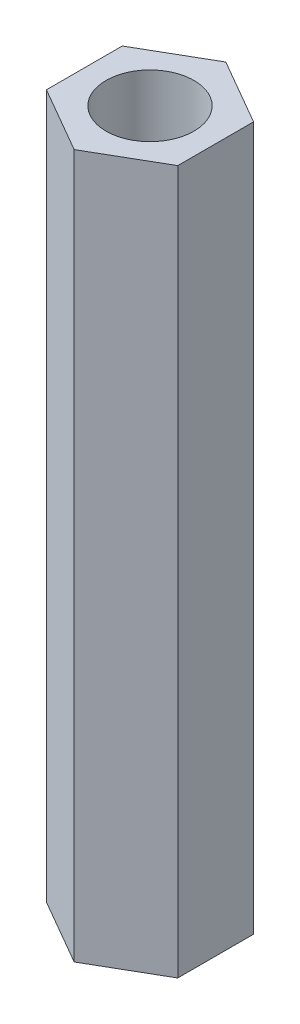
ISO-10303-21;
HEADER;
FILE_DESCRIPTION(('STEP AP214'),'2;1');
FILE_NAME('part.step','',(''),(''),'','','');
FILE_SCHEMA(('AUTOMOTIVE_DESIGN { 1 0 10303 214 1 1 1 1 }'));
ENDSEC;
DATA;
#1=APPLICATION_CONTEXT('core data for automotive mechanical design processes');
#2=APPLICATION_PROTOCOL_DEFINITION('international standard','automotive_design',2000,#1);
#3=PRODUCT_CONTEXT('',#1,'mechanical');
#4=PRODUCT('Part','Part','',(#3));
#5=PRODUCT_RELATED_PRODUCT_CATEGORY('part','',(#4));
#6=PRODUCT_DEFINITION_FORMATION('','',#4);
#7=PRODUCT_DEFINITION_CONTEXT('part definition',#1,'design');
#8=PRODUCT_DEFINITION('design','',#6,#7);
#9=PRODUCT_DEFINITION_SHAPE('','',#8);
#10=(LENGTH_UNIT() NAMED_UNIT(*) SI_UNIT(.MILLI.,.METRE.));
#11=(NAMED_UNIT(*) PLANE_ANGLE_UNIT() SI_UNIT($,.RADIAN.));
#12=(NAMED_UNIT(*) SI_UNIT($,.STERADIAN.) SOLID_ANGLE_UNIT());
#13=UNCERTAINTY_MEASURE_WITH_UNIT(LENGTH_MEASURE(1.E-05),#10,'distance_accuracy_value','');
#14=(GEOMETRIC_REPRESENTATION_CONTEXT(3) GLOBAL_UNCERTAINTY_ASSIGNED_CONTEXT((#13)) GLOBAL_UNIT_ASSIGNED_CONTEXT((#10,
#11,#12)) REPRESENTATION_CONTEXT('',''));
#15=CARTESIAN_POINT('',(0.,0.,0.));
#16=DIRECTION('',(0.,0.,1.));
#17=DIRECTION('',(1.,0.,0.));
#18=AXIS2_PLACEMENT_3D('',#15,#16,#17);
#19=CARTESIAN_POINT('',(0.,19.05,0.));
#20=DIRECTION('',(0.,1.,0.));
#21=DIRECTION('',(0.,0.,1.));
#22=AXIS2_PLACEMENT_3D('',#19,#20,#21);
#23=PLANE('',#22);
#24=DIRECTION('',(0.866025403784438,0.,0.5));
#25=VECTOR('',#24,1.);
#26=CARTESIAN_POINT('',(-1.778,19.05,1.02652877861915));
#27=LINE('',#26,#25);
#28=CARTESIAN_POINT('',(-1.778,19.05,1.02652877861915));
#29=VERTEX_POINT('',#28);
#30=CARTESIAN_POINT('',(0.,19.05,2.05305755723831));
#31=VERTEX_POINT('',#30);
#32=EDGE_CURVE('E129',#29,#31,#27,.T.);
#33=ORIENTED_EDGE('',*,*,#32,.T.);
#34=DIRECTION('',(0.866025403784439,0.,-0.5));
#35=VECTOR('',#34,1.);
#36=CARTESIAN_POINT('',(0.,19.05,2.05305755723831));
#37=LINE('',#36,#35);
#38=CARTESIAN_POINT('',(1.778,19.05,1.02652877861915));
#39=VERTEX_POINT('',#38);
#40=EDGE_CURVE('E87',#31,#39,#37,.T.);
#41=ORIENTED_EDGE('',*,*,#40,.T.);
#42=DIRECTION('',(0.,0.,-1.));
#43=VECTOR('',#42,1.);
#44=CARTESIAN_POINT('',(1.778,19.05,1.02652877861915));
#45=LINE('',#44,#43);
#46=CARTESIAN_POINT('',(1.778,19.05,-1.02652877861915));
#47=VERTEX_POINT('',#46);
#48=EDGE_CURVE('E100',#39,#47,#45,.T.);
#49=ORIENTED_EDGE('',*,*,#48,.T.);
#50=DIRECTION('',(-0.866025403784439,0.,-0.5));
#51=VECTOR('',#50,1.);
#52=CARTESIAN_POINT('',(1.778,19.05,-1.02652877861915));
#53=LINE('',#52,#51);
#54=CARTESIAN_POINT('',(0.,19.05,-2.05305755723831));
#55=VERTEX_POINT('',#54);
#56=EDGE_CURVE('E94',#47,#55,#53,.T.);
#57=ORIENTED_EDGE('',*,*,#56,.T.);
#58=DIRECTION('',(-0.866025403784439,0.,0.5));
#59=VECTOR('',#58,1.);
#60=CARTESIAN_POINT('',(0.,19.05,-2.05305755723831));
#61=LINE('',#60,#59);
#62=CARTESIAN_POINT('',(-1.778,19.05,-1.02652877861915));
#63=VERTEX_POINT('',#62);
#64=EDGE_CURVE('E98',#55,#63,#61,.T.);
#65=ORIENTED_EDGE('',*,*,#64,.T.);
#66=DIRECTION('',(0.,0.,1.));
#67=VECTOR('',#66,1.);
#68=CARTESIAN_POINT('',(-1.778,19.05,-1.02652877861915));
#69=LINE('',#68,#67);
#70=EDGE_CURVE('E50',#63,#29,#69,.T.);
#71=ORIENTED_EDGE('',*,*,#70,.T.);
#72=EDGE_LOOP('',(#33,#41,#49,#57,#65,#71));
#73=FACE_BOUND('',#72,.T.);
#74=CARTESIAN_POINT('',(0.,19.05,0.));
#75=DIRECTION('',(0.,1.,0.));
#76=DIRECTION('',(0.,0.,1.));
#77=AXIS2_PLACEMENT_3D('',#74,#75,#76);
#78=CIRCLE('',#77,1.190625);
#79=CARTESIAN_POINT('',(0.,19.05,1.190625));
#80=VERTEX_POINT('',#79);
#81=EDGE_CURVE('E122',#80,#80,#78,.T.);
#82=ORIENTED_EDGE('',*,*,#81,.F.);
#83=EDGE_LOOP('',(#82));
#84=FACE_BOUND('',#83,.T.);
#85=ADVANCED_FACE('F33',(#73,#84),#23,.T.);
#86=CARTESIAN_POINT('',(0.,0.,0.));
#87=DIRECTION('',(0.,1.,0.));
#88=DIRECTION('',(0.,0.,1.));
#89=AXIS2_PLACEMENT_3D('',#86,#87,#88);
#90=PLANE('',#89);
#91=DIRECTION('',(0.866025403784438,0.,0.5));
#92=VECTOR('',#91,1.);
#93=CARTESIAN_POINT('',(-1.778,0.,1.02652877861915));
#94=LINE('',#93,#92);
#95=CARTESIAN_POINT('',(-1.778,0.,1.02652877861915));
#96=VERTEX_POINT('',#95);
#97=CARTESIAN_POINT('',(0.,0.,2.05305755723831));
#98=VERTEX_POINT('',#97);
#99=EDGE_CURVE('E118',#96,#98,#94,.T.);
#100=ORIENTED_EDGE('',*,*,#99,.F.);
#101=DIRECTION('',(0.,0.,1.));
#102=VECTOR('',#101,1.);
#103=CARTESIAN_POINT('',(-1.778,0.,-1.02652877861915));
#104=LINE('',#103,#102);
#105=CARTESIAN_POINT('',(-1.778,0.,-1.02652877861915));
#106=VERTEX_POINT('',#105);
#107=EDGE_CURVE('E79',#106,#96,#104,.T.);
#108=ORIENTED_EDGE('',*,*,#107,.F.);
#109=DIRECTION('',(-0.866025403784439,0.,0.5));
#110=VECTOR('',#109,1.);
#111=CARTESIAN_POINT('',(0.,0.,-2.05305755723831));
#112=LINE('',#111,#110);
#113=CARTESIAN_POINT('',(0.,0.,-2.05305755723831));
#114=VERTEX_POINT('',#113);
#115=EDGE_CURVE('E73',#114,#106,#112,.T.);
#116=ORIENTED_EDGE('',*,*,#115,.F.);
#117=DIRECTION('',(-0.866025403784439,0.,-0.5));
#118=VECTOR('',#117,1.);
#119=CARTESIAN_POINT('',(1.778,0.,-1.02652877861915));
#120=LINE('',#119,#118);
#121=CARTESIAN_POINT('',(1.778,0.,-1.02652877861915));
#122=VERTEX_POINT('',#121);
#123=EDGE_CURVE('E108',#122,#114,#120,.T.);
#124=ORIENTED_EDGE('',*,*,#123,.F.);
#125=DIRECTION('',(0.,0.,-1.));
#126=VECTOR('',#125,1.);
#127=CARTESIAN_POINT('',(1.778,0.,1.02652877861915));
#128=LINE('',#127,#126);
#129=CARTESIAN_POINT('',(1.778,0.,1.02652877861915));
#130=VERTEX_POINT('',#129);
#131=EDGE_CURVE('E124',#130,#122,#128,.T.);
#132=ORIENTED_EDGE('',*,*,#131,.F.);
#133=DIRECTION('',(0.866025403784439,0.,-0.5));
#134=VECTOR('',#133,1.);
#135=CARTESIAN_POINT('',(0.,0.,2.05305755723831));
#136=LINE('',#135,#134);
#137=EDGE_CURVE('E121',#98,#130,#136,.T.);
#138=ORIENTED_EDGE('',*,*,#137,.F.);
#139=EDGE_LOOP('',(#100,#108,#116,#124,#132,#138));
#140=FACE_BOUND('',#139,.T.);
#141=CARTESIAN_POINT('',(0.,0.,0.));
#142=DIRECTION('',(0.,1.,0.));
#143=DIRECTION('',(0.,0.,1.));
#144=AXIS2_PLACEMENT_3D('',#141,#142,#143);
#145=CIRCLE('',#144,1.190625);
#146=CARTESIAN_POINT('',(0.,0.,1.190625));
#147=VERTEX_POINT('',#146);
#148=EDGE_CURVE('E222',#147,#147,#145,.T.);
#149=ORIENTED_EDGE('',*,*,#148,.T.);
#150=EDGE_LOOP('',(#149));
#151=FACE_BOUND('',#150,.T.);
#152=ADVANCED_FACE('F138',(#140,#151),#90,.F.);
#153=CARTESIAN_POINT('',(-1.778,19.05,1.02652877861915));
#154=DIRECTION('',(0.5,0.,-0.866025403784439));
#155=DIRECTION('',(-0.866025403784438,0.,-0.5));
#156=AXIS2_PLACEMENT_3D('',#153,#154,#155);
#157=PLANE('',#156);
#158=ORIENTED_EDGE('',*,*,#99,.T.);
#159=DIRECTION('',(0.,-1.,0.));
#160=VECTOR('',#159,1.);
#161=CARTESIAN_POINT('',(0.,19.05,2.05305755723831));
#162=LINE('',#161,#160);
#163=EDGE_CURVE('E11',#31,#98,#162,.T.);
#164=ORIENTED_EDGE('',*,*,#163,.F.);
#165=ORIENTED_EDGE('',*,*,#32,.F.);
#166=DIRECTION('',(0.,-1.,0.));
#167=VECTOR('',#166,1.);
#168=CARTESIAN_POINT('',(-1.778,19.05,1.02652877861915));
#169=LINE('',#168,#167);
#170=EDGE_CURVE('E114',#29,#96,#169,.T.);
#171=ORIENTED_EDGE('',*,*,#170,.T.);
#172=EDGE_LOOP('',(#158,#164,#165,#171));
#173=FACE_BOUND('',#172,.T.);
#174=ADVANCED_FACE('F35',(#173),#157,.F.);
#175=CARTESIAN_POINT('',(0.,19.05,2.05305755723831));
#176=DIRECTION('',(-0.5,0.,-0.866025403784439));
#177=DIRECTION('',(-0.866025403784439,0.,0.5));
#178=AXIS2_PLACEMENT_3D('',#175,#176,#177);
#179=PLANE('',#178);
#180=ORIENTED_EDGE('',*,*,#137,.T.);
#181=DIRECTION('',(0.,-1.,0.));
#182=VECTOR('',#181,1.);
#183=CARTESIAN_POINT('',(1.778,19.05,1.02652877861915));
#184=LINE('',#183,#182);
#185=EDGE_CURVE('E42',#39,#130,#184,.T.);
#186=ORIENTED_EDGE('',*,*,#185,.F.);
#187=ORIENTED_EDGE('',*,*,#40,.F.);
#188=ORIENTED_EDGE('',*,*,#163,.T.);
#189=EDGE_LOOP('',(#180,#186,#187,#188));
#190=FACE_BOUND('',#189,.T.);
#191=ADVANCED_FACE('F163',(#190),#179,.F.);
#192=CARTESIAN_POINT('',(1.778,19.05,1.02652877861915));
#193=DIRECTION('',(-1.,0.,0.));
#194=DIRECTION('',(0.,0.,1.));
#195=AXIS2_PLACEMENT_3D('',#192,#193,#194);
#196=PLANE('',#195);
#197=ORIENTED_EDGE('',*,*,#131,.T.);
#198=DIRECTION('',(0.,-1.,0.));
#199=VECTOR('',#198,1.);
#200=CARTESIAN_POINT('',(1.778,19.05,-1.02652877861915));
#201=LINE('',#200,#199);
#202=EDGE_CURVE('E109',#47,#122,#201,.T.);
#203=ORIENTED_EDGE('',*,*,#202,.F.);
#204=ORIENTED_EDGE('',*,*,#48,.F.);
#205=ORIENTED_EDGE('',*,*,#185,.T.);
#206=EDGE_LOOP('',(#197,#203,#204,#205));
#207=FACE_BOUND('',#206,.T.);
#208=ADVANCED_FACE('F135',(#207),#196,.F.);
#209=CARTESIAN_POINT('',(1.778,19.05,-1.02652877861915));
#210=DIRECTION('',(-0.5,0.,0.866025403784439));
#211=DIRECTION('',(0.866025403784438,0.,0.5));
#212=AXIS2_PLACEMENT_3D('',#209,#210,#211);
#213=PLANE('',#212);
#214=ORIENTED_EDGE('',*,*,#123,.T.);
#215=DIRECTION('',(0.,-1.,0.));
#216=VECTOR('',#215,1.);
#217=CARTESIAN_POINT('',(0.,19.05,-2.05305755723831));
#218=LINE('',#217,#216);
#219=EDGE_CURVE('E105',#55,#114,#218,.T.);
#220=ORIENTED_EDGE('',*,*,#219,.F.);
#221=ORIENTED_EDGE('',*,*,#56,.F.);
#222=ORIENTED_EDGE('',*,*,#202,.T.);
#223=EDGE_LOOP('',(#214,#220,#221,#222));
#224=FACE_BOUND('',#223,.T.);
#225=ADVANCED_FACE('F106',(#224),#213,.F.);
#226=CARTESIAN_POINT('',(0.,19.05,-2.05305755723831));
#227=DIRECTION('',(0.5,0.,0.866025403784439));
#228=DIRECTION('',(0.866025403784439,0.,-0.5));
#229=AXIS2_PLACEMENT_3D('',#226,#227,#228);
#230=PLANE('',#229);
#231=ORIENTED_EDGE('',*,*,#115,.T.);
#232=DIRECTION('',(0.,-1.,0.));
#233=VECTOR('',#232,1.);
#234=CARTESIAN_POINT('',(-1.778,19.05,-1.02652877861915));
#235=LINE('',#234,#233);
#236=EDGE_CURVE('E110',#63,#106,#235,.T.);
#237=ORIENTED_EDGE('',*,*,#236,.F.);
#238=ORIENTED_EDGE('',*,*,#64,.F.);
#239=ORIENTED_EDGE('',*,*,#219,.T.);
#240=EDGE_LOOP('',(#231,#237,#238,#239));
#241=FACE_BOUND('',#240,.T.);
#242=ADVANCED_FACE('F112',(#241),#230,.F.);
#243=CARTESIAN_POINT('',(-1.778,19.05,-1.02652877861915));
#244=DIRECTION('',(1.,0.,0.));
#245=DIRECTION('',(0.,0.,-1.));
#246=AXIS2_PLACEMENT_3D('',#243,#244,#245);
#247=PLANE('',#246);
#248=ORIENTED_EDGE('',*,*,#107,.T.);
#249=ORIENTED_EDGE('',*,*,#170,.F.);
#250=ORIENTED_EDGE('',*,*,#70,.F.);
#251=ORIENTED_EDGE('',*,*,#236,.T.);
#252=EDGE_LOOP('',(#248,#249,#250,#251));
#253=FACE_BOUND('',#252,.T.);
#254=ADVANCED_FACE('F143',(#253),#247,.F.);
#255=CARTESIAN_POINT('',(0.,19.05,0.));
#256=DIRECTION('',(0.,-1.,0.));
#257=DIRECTION('',(0.,0.,-1.));
#258=AXIS2_PLACEMENT_3D('',#255,#256,#257);
#259=CYLINDRICAL_SURFACE('',#258,1.190625);
#260=ORIENTED_EDGE('',*,*,#81,.T.);
#261=EDGE_LOOP('',(#260));
#262=FACE_BOUND('',#261,.T.);
#263=ORIENTED_EDGE('',*,*,#148,.F.);
#264=EDGE_LOOP('',(#263));
#265=FACE_BOUND('',#264,.T.);
#266=ADVANCED_FACE('F145',(#262,#265),#259,.F.);
#267=CLOSED_SHELL('',(#85,#152,#174,#191,#208,#225,#242,#254,#266));
#268=MANIFOLD_SOLID_BREP('B2',#267);
#269=ADVANCED_BREP_SHAPE_REPRESENTATION('',(#18,#268),#14);
#270=SHAPE_DEFINITION_REPRESENTATION(#9,#269);
ENDSEC;
END-ISO-10303-21;
